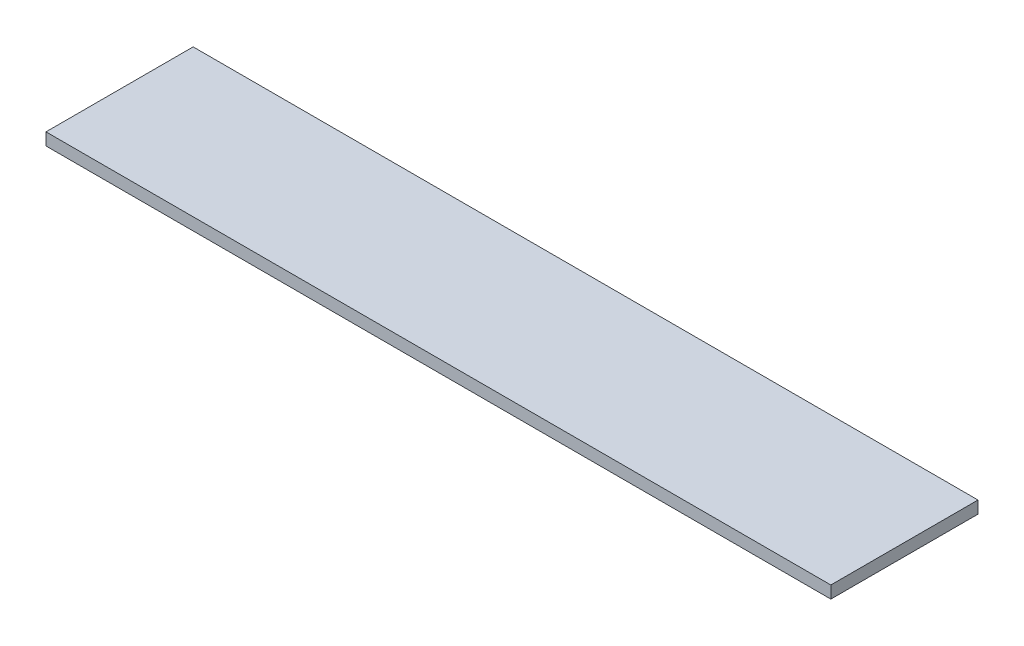
ISO-10303-21;
HEADER;
FILE_DESCRIPTION(('STEP AP214'),'2;1');
FILE_NAME('part.step','',(''),(''),'','','');
FILE_SCHEMA(('AUTOMOTIVE_DESIGN { 1 0 10303 214 1 1 1 1 }'));
ENDSEC;
DATA;
#1=APPLICATION_CONTEXT('core data for automotive mechanical design processes');
#2=APPLICATION_PROTOCOL_DEFINITION('international standard','automotive_design',2000,#1);
#3=PRODUCT_CONTEXT('',#1,'mechanical');
#4=PRODUCT('Part','Part','',(#3));
#5=PRODUCT_RELATED_PRODUCT_CATEGORY('part','',(#4));
#6=PRODUCT_DEFINITION_FORMATION('','',#4);
#7=PRODUCT_DEFINITION_CONTEXT('part definition',#1,'design');
#8=PRODUCT_DEFINITION('design','',#6,#7);
#9=PRODUCT_DEFINITION_SHAPE('','',#8);
#10=(LENGTH_UNIT() NAMED_UNIT(*) SI_UNIT(.MILLI.,.METRE.));
#11=(NAMED_UNIT(*) PLANE_ANGLE_UNIT() SI_UNIT($,.RADIAN.));
#12=(NAMED_UNIT(*) SI_UNIT($,.STERADIAN.) SOLID_ANGLE_UNIT());
#13=UNCERTAINTY_MEASURE_WITH_UNIT(LENGTH_MEASURE(1.E-05),#10,'distance_accuracy_value','');
#14=(GEOMETRIC_REPRESENTATION_CONTEXT(3) GLOBAL_UNCERTAINTY_ASSIGNED_CONTEXT((#13)) GLOBAL_UNIT_ASSIGNED_CONTEXT((#10,
#11,#12)) REPRESENTATION_CONTEXT('',''));
#15=CARTESIAN_POINT('',(0.,0.,0.));
#16=DIRECTION('',(0.,0.,1.));
#17=DIRECTION('',(1.,0.,0.));
#18=AXIS2_PLACEMENT_3D('',#15,#16,#17);
#19=CARTESIAN_POINT('',(0.,6.35,0.));
#20=DIRECTION('',(1.,0.,0.));
#21=DIRECTION('',(0.,0.,-1.));
#22=AXIS2_PLACEMENT_3D('',#19,#20,#21);
#23=PLANE('',#22);
#24=DIRECTION('',(0.,0.,1.));
#25=VECTOR('',#24,1.);
#26=CARTESIAN_POINT('',(0.,0.,0.));
#27=LINE('',#26,#25);
#28=CARTESIAN_POINT('',(0.,0.,-76.2));
#29=VERTEX_POINT('',#28);
#30=CARTESIAN_POINT('',(0.,0.,0.));
#31=VERTEX_POINT('',#30);
#32=EDGE_CURVE('E102',#29,#31,#27,.T.);
#33=ORIENTED_EDGE('',*,*,#32,.T.);
#34=DIRECTION('',(0.,-1.,0.));
#35=VECTOR('',#34,1.);
#36=CARTESIAN_POINT('',(0.,6.35,0.));
#37=LINE('',#36,#35);
#38=CARTESIAN_POINT('',(0.,6.35,0.));
#39=VERTEX_POINT('',#38);
#40=EDGE_CURVE('E11',#39,#31,#37,.T.);
#41=ORIENTED_EDGE('',*,*,#40,.F.);
#42=DIRECTION('',(0.,0.,1.));
#43=VECTOR('',#42,1.);
#44=CARTESIAN_POINT('',(0.,6.35,0.));
#45=LINE('',#44,#43);
#46=CARTESIAN_POINT('',(0.,6.35,-76.2));
#47=VERTEX_POINT('',#46);
#48=EDGE_CURVE('E90',#47,#39,#45,.T.);
#49=ORIENTED_EDGE('',*,*,#48,.F.);
#50=DIRECTION('',(0.,-1.,0.));
#51=VECTOR('',#50,1.);
#52=CARTESIAN_POINT('',(0.,6.35,-76.2));
#53=LINE('',#52,#51);
#54=EDGE_CURVE('E98',#47,#29,#53,.T.);
#55=ORIENTED_EDGE('',*,*,#54,.T.);
#56=EDGE_LOOP('',(#33,#41,#49,#55));
#57=FACE_BOUND('',#56,.T.);
#58=ADVANCED_FACE('F39',(#57),#23,.F.);
#59=CARTESIAN_POINT('',(0.,6.35,0.));
#60=DIRECTION('',(0.,0.,-1.));
#61=DIRECTION('',(-1.,0.,0.));
#62=AXIS2_PLACEMENT_3D('',#59,#60,#61);
#63=PLANE('',#62);
#64=DIRECTION('',(1.,0.,0.));
#65=VECTOR('',#64,1.);
#66=CARTESIAN_POINT('',(0.,0.,0.));
#67=LINE('',#66,#65);
#68=CARTESIAN_POINT('',(406.4,0.,0.));
#69=VERTEX_POINT('',#68);
#70=EDGE_CURVE('E94',#31,#69,#67,.T.);
#71=ORIENTED_EDGE('',*,*,#70,.T.);
#72=DIRECTION('',(0.,-1.,0.));
#73=VECTOR('',#72,1.);
#74=CARTESIAN_POINT('',(406.4,6.35,0.));
#75=LINE('',#74,#73);
#76=CARTESIAN_POINT('',(406.4,6.35,0.));
#77=VERTEX_POINT('',#76);
#78=EDGE_CURVE('E47',#77,#69,#75,.T.);
#79=ORIENTED_EDGE('',*,*,#78,.F.);
#80=DIRECTION('',(1.,0.,0.));
#81=VECTOR('',#80,1.);
#82=CARTESIAN_POINT('',(0.,6.35,0.));
#83=LINE('',#82,#81);
#84=EDGE_CURVE('E85',#39,#77,#83,.T.);
#85=ORIENTED_EDGE('',*,*,#84,.F.);
#86=ORIENTED_EDGE('',*,*,#40,.T.);
#87=EDGE_LOOP('',(#71,#79,#85,#86));
#88=FACE_BOUND('',#87,.T.);
#89=ADVANCED_FACE('F93',(#88),#63,.F.);
#90=CARTESIAN_POINT('',(406.4,6.35,0.));
#91=DIRECTION('',(-1.,0.,0.));
#92=DIRECTION('',(0.,0.,1.));
#93=AXIS2_PLACEMENT_3D('',#90,#91,#92);
#94=PLANE('',#93);
#95=DIRECTION('',(0.,0.,-1.));
#96=VECTOR('',#95,1.);
#97=CARTESIAN_POINT('',(406.4,0.,0.));
#98=LINE('',#97,#96);
#99=CARTESIAN_POINT('',(406.4,0.,-76.2));
#100=VERTEX_POINT('',#99);
#101=EDGE_CURVE('E72',#69,#100,#98,.T.);
#102=ORIENTED_EDGE('',*,*,#101,.T.);
#103=DIRECTION('',(0.,-1.,0.));
#104=VECTOR('',#103,1.);
#105=CARTESIAN_POINT('',(406.4,6.35,-76.2));
#106=LINE('',#105,#104);
#107=CARTESIAN_POINT('',(406.4,6.35,-76.2));
#108=VERTEX_POINT('',#107);
#109=EDGE_CURVE('E95',#108,#100,#106,.T.);
#110=ORIENTED_EDGE('',*,*,#109,.F.);
#111=DIRECTION('',(0.,0.,-1.));
#112=VECTOR('',#111,1.);
#113=CARTESIAN_POINT('',(406.4,6.35,0.));
#114=LINE('',#113,#112);
#115=EDGE_CURVE('E88',#77,#108,#114,.T.);
#116=ORIENTED_EDGE('',*,*,#115,.F.);
#117=ORIENTED_EDGE('',*,*,#78,.T.);
#118=EDGE_LOOP('',(#102,#110,#116,#117));
#119=FACE_BOUND('',#118,.T.);
#120=ADVANCED_FACE('F96',(#119),#94,.F.);
#121=CARTESIAN_POINT('',(0.,6.35,-76.2));
#122=DIRECTION('',(0.,0.,1.));
#123=DIRECTION('',(1.,0.,0.));
#124=AXIS2_PLACEMENT_3D('',#121,#122,#123);
#125=PLANE('',#124);
#126=DIRECTION('',(-1.,0.,0.));
#127=VECTOR('',#126,1.);
#128=CARTESIAN_POINT('',(0.,0.,-76.2));
#129=LINE('',#128,#127);
#130=EDGE_CURVE('E78',#100,#29,#129,.T.);
#131=ORIENTED_EDGE('',*,*,#130,.T.);
#132=ORIENTED_EDGE('',*,*,#54,.F.);
#133=DIRECTION('',(-1.,0.,0.));
#134=VECTOR('',#133,1.);
#135=CARTESIAN_POINT('',(0.,6.35,-76.2));
#136=LINE('',#135,#134);
#137=EDGE_CURVE('E55',#108,#47,#136,.T.);
#138=ORIENTED_EDGE('',*,*,#137,.F.);
#139=ORIENTED_EDGE('',*,*,#109,.T.);
#140=EDGE_LOOP('',(#131,#132,#138,#139));
#141=FACE_BOUND('',#140,.T.);
#142=ADVANCED_FACE('F109',(#141),#125,.F.);
#143=CARTESIAN_POINT('',(0.,6.35,0.));
#144=DIRECTION('',(0.,-1.,0.));
#145=DIRECTION('',(0.,0.,-1.));
#146=AXIS2_PLACEMENT_3D('',#143,#144,#145);
#147=PLANE('',#146);
#148=ORIENTED_EDGE('',*,*,#48,.T.);
#149=ORIENTED_EDGE('',*,*,#84,.T.);
#150=ORIENTED_EDGE('',*,*,#115,.T.);
#151=ORIENTED_EDGE('',*,*,#137,.T.);
#152=EDGE_LOOP('',(#148,#149,#150,#151));
#153=FACE_BOUND('',#152,.T.);
#154=ADVANCED_FACE('F86',(#153),#147,.F.);
#155=CARTESIAN_POINT('',(0.,0.,0.));
#156=DIRECTION('',(0.,-1.,0.));
#157=DIRECTION('',(0.,0.,-1.));
#158=AXIS2_PLACEMENT_3D('',#155,#156,#157);
#159=PLANE('',#158);
#160=ORIENTED_EDGE('',*,*,#32,.F.);
#161=ORIENTED_EDGE('',*,*,#130,.F.);
#162=ORIENTED_EDGE('',*,*,#101,.F.);
#163=ORIENTED_EDGE('',*,*,#70,.F.);
#164=EDGE_LOOP('',(#160,#161,#162,#163));
#165=FACE_BOUND('',#164,.T.);
#166=ADVANCED_FACE('F112',(#165),#159,.T.);
#167=CLOSED_SHELL('',(#58,#89,#120,#142,#154,#166));
#168=MANIFOLD_SOLID_BREP('B2',#167);
#169=ADVANCED_BREP_SHAPE_REPRESENTATION('',(#18,#168),#14);
#170=SHAPE_DEFINITION_REPRESENTATION(#9,#169);
ENDSEC;
END-ISO-10303-21;
